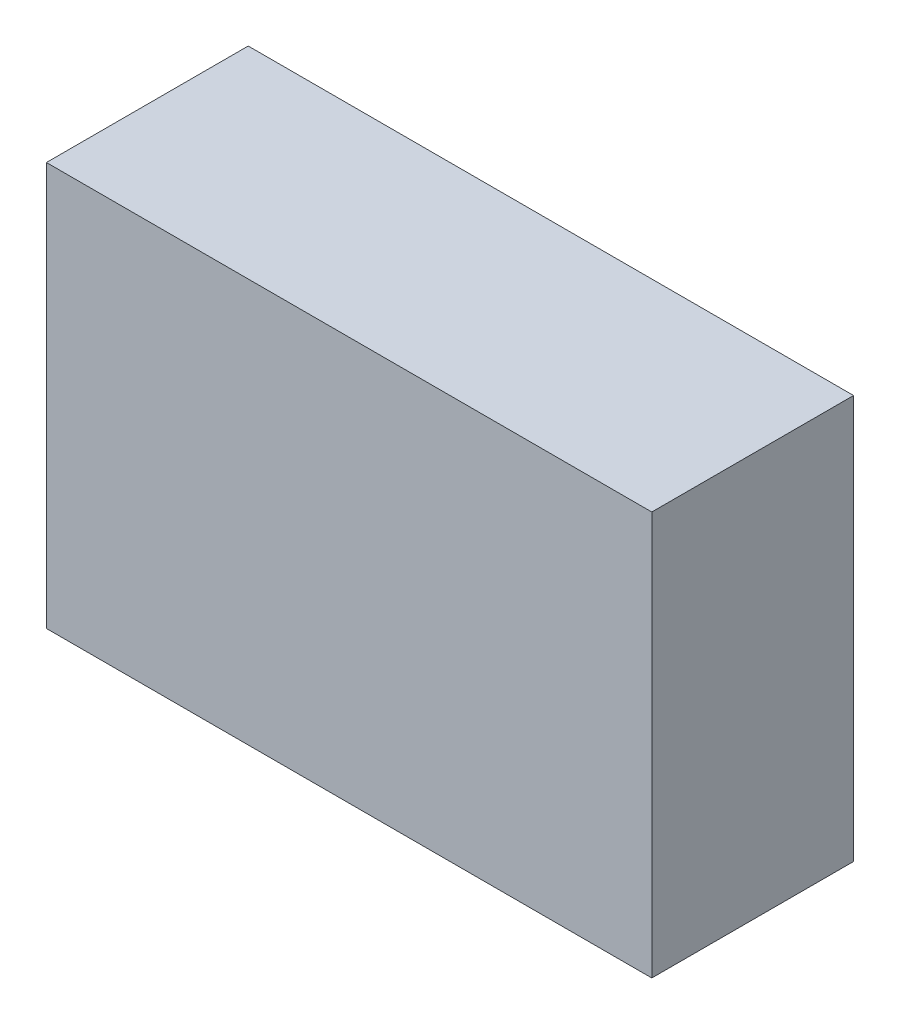
ISO-10303-21;
HEADER;
FILE_DESCRIPTION(('STEP AP214'),'2;1');
FILE_NAME('part.step','',(''),(''),'','','');
FILE_SCHEMA(('AUTOMOTIVE_DESIGN { 1 0 10303 214 1 1 1 1 }'));
ENDSEC;
DATA;
#1=APPLICATION_CONTEXT('core data for automotive mechanical design processes');
#2=APPLICATION_PROTOCOL_DEFINITION('international standard','automotive_design',2000,#1);
#3=PRODUCT_CONTEXT('',#1,'mechanical');
#4=PRODUCT('Part','Part','',(#3));
#5=PRODUCT_RELATED_PRODUCT_CATEGORY('part','',(#4));
#6=PRODUCT_DEFINITION_FORMATION('','',#4);
#7=PRODUCT_DEFINITION_CONTEXT('part definition',#1,'design');
#8=PRODUCT_DEFINITION('design','',#6,#7);
#9=PRODUCT_DEFINITION_SHAPE('','',#8);
#10=(LENGTH_UNIT() NAMED_UNIT(*) SI_UNIT(.MILLI.,.METRE.));
#11=(NAMED_UNIT(*) PLANE_ANGLE_UNIT() SI_UNIT($,.RADIAN.));
#12=(NAMED_UNIT(*) SI_UNIT($,.STERADIAN.) SOLID_ANGLE_UNIT());
#13=UNCERTAINTY_MEASURE_WITH_UNIT(LENGTH_MEASURE(1.E-05),#10,'distance_accuracy_value','');
#14=(GEOMETRIC_REPRESENTATION_CONTEXT(3) GLOBAL_UNCERTAINTY_ASSIGNED_CONTEXT((#13)) GLOBAL_UNIT_ASSIGNED_CONTEXT((#10,
#11,#12)) REPRESENTATION_CONTEXT('',''));
#15=CARTESIAN_POINT('',(0.,0.,0.));
#16=DIRECTION('',(0.,0.,1.));
#17=DIRECTION('',(1.,0.,0.));
#18=AXIS2_PLACEMENT_3D('',#15,#16,#17);
#19=CARTESIAN_POINT('',(0.,2.,0.));
#20=DIRECTION('',(1.,0.,0.));
#21=DIRECTION('',(0.,0.,-1.));
#22=AXIS2_PLACEMENT_3D('',#19,#20,#21);
#23=PLANE('',#22);
#24=DIRECTION('',(0.,0.,1.));
#25=VECTOR('',#24,1.);
#26=CARTESIAN_POINT('',(0.,0.,0.));
#27=LINE('',#26,#25);
#28=CARTESIAN_POINT('',(0.,0.,0.));
#29=VERTEX_POINT('',#28);
#30=CARTESIAN_POINT('',(0.,0.,1.));
#31=VERTEX_POINT('',#30);
#32=EDGE_CURVE('E107',#29,#31,#27,.T.);
#33=ORIENTED_EDGE('',*,*,#32,.T.);
#34=DIRECTION('',(0.,-1.,0.));
#35=VECTOR('',#34,1.);
#36=CARTESIAN_POINT('',(0.,2.,1.));
#37=LINE('',#36,#35);
#38=CARTESIAN_POINT('',(0.,2.,1.));
#39=VERTEX_POINT('',#38);
#40=EDGE_CURVE('E11',#39,#31,#37,.T.);
#41=ORIENTED_EDGE('',*,*,#40,.F.);
#42=DIRECTION('',(0.,0.,1.));
#43=VECTOR('',#42,1.);
#44=CARTESIAN_POINT('',(0.,2.,0.));
#45=LINE('',#44,#43);
#46=CARTESIAN_POINT('',(0.,2.,0.));
#47=VERTEX_POINT('',#46);
#48=EDGE_CURVE('E91',#47,#39,#45,.T.);
#49=ORIENTED_EDGE('',*,*,#48,.F.);
#50=DIRECTION('',(0.,-1.,0.));
#51=VECTOR('',#50,1.);
#52=CARTESIAN_POINT('',(0.,2.,0.));
#53=LINE('',#52,#51);
#54=EDGE_CURVE('E103',#47,#29,#53,.T.);
#55=ORIENTED_EDGE('',*,*,#54,.T.);
#56=EDGE_LOOP('',(#33,#41,#49,#55));
#57=FACE_BOUND('',#56,.T.);
#58=ADVANCED_FACE('F39',(#57),#23,.F.);
#59=CARTESIAN_POINT('',(0.,2.,1.));
#60=DIRECTION('',(0.,0.,-1.));
#61=DIRECTION('',(-1.,0.,0.));
#62=AXIS2_PLACEMENT_3D('',#59,#60,#61);
#63=PLANE('',#62);
#64=DIRECTION('',(1.,0.,0.));
#65=VECTOR('',#64,1.);
#66=CARTESIAN_POINT('',(0.,0.,1.));
#67=LINE('',#66,#65);
#68=CARTESIAN_POINT('',(3.,0.,1.));
#69=VERTEX_POINT('',#68);
#70=EDGE_CURVE('E96',#31,#69,#67,.T.);
#71=ORIENTED_EDGE('',*,*,#70,.T.);
#72=DIRECTION('',(0.,-1.,0.));
#73=VECTOR('',#72,1.);
#74=CARTESIAN_POINT('',(3.,2.,1.));
#75=LINE('',#74,#73);
#76=CARTESIAN_POINT('',(3.,2.,1.));
#77=VERTEX_POINT('',#76);
#78=EDGE_CURVE('E48',#77,#69,#75,.T.);
#79=ORIENTED_EDGE('',*,*,#78,.F.);
#80=DIRECTION('',(1.,0.,0.));
#81=VECTOR('',#80,1.);
#82=CARTESIAN_POINT('',(0.,2.,1.));
#83=LINE('',#82,#81);
#84=EDGE_CURVE('E86',#39,#77,#83,.T.);
#85=ORIENTED_EDGE('',*,*,#84,.F.);
#86=ORIENTED_EDGE('',*,*,#40,.T.);
#87=EDGE_LOOP('',(#71,#79,#85,#86));
#88=FACE_BOUND('',#87,.T.);
#89=ADVANCED_FACE('F95',(#88),#63,.F.);
#90=CARTESIAN_POINT('',(3.,2.,0.));
#91=DIRECTION('',(-1.,0.,0.));
#92=DIRECTION('',(0.,0.,1.));
#93=AXIS2_PLACEMENT_3D('',#90,#91,#92);
#94=PLANE('',#93);
#95=DIRECTION('',(0.,0.,-1.));
#96=VECTOR('',#95,1.);
#97=CARTESIAN_POINT('',(3.,0.,0.));
#98=LINE('',#97,#96);
#99=CARTESIAN_POINT('',(3.,0.,0.));
#100=VERTEX_POINT('',#99);
#101=EDGE_CURVE('E73',#69,#100,#98,.T.);
#102=ORIENTED_EDGE('',*,*,#101,.T.);
#103=DIRECTION('',(0.,-1.,0.));
#104=VECTOR('',#103,1.);
#105=CARTESIAN_POINT('',(3.,2.,0.));
#106=LINE('',#105,#104);
#107=CARTESIAN_POINT('',(3.,2.,0.));
#108=VERTEX_POINT('',#107);
#109=EDGE_CURVE('E98',#108,#100,#106,.T.);
#110=ORIENTED_EDGE('',*,*,#109,.F.);
#111=DIRECTION('',(0.,0.,-1.));
#112=VECTOR('',#111,1.);
#113=CARTESIAN_POINT('',(3.,2.,0.));
#114=LINE('',#113,#112);
#115=EDGE_CURVE('E89',#77,#108,#114,.T.);
#116=ORIENTED_EDGE('',*,*,#115,.F.);
#117=ORIENTED_EDGE('',*,*,#78,.T.);
#118=EDGE_LOOP('',(#102,#110,#116,#117));
#119=FACE_BOUND('',#118,.T.);
#120=ADVANCED_FACE('F99',(#119),#94,.F.);
#121=CARTESIAN_POINT('',(0.,2.,0.));
#122=DIRECTION('',(0.,0.,1.));
#123=DIRECTION('',(1.,0.,0.));
#124=AXIS2_PLACEMENT_3D('',#121,#122,#123);
#125=PLANE('',#124);
#126=DIRECTION('',(-1.,0.,0.));
#127=VECTOR('',#126,1.);
#128=CARTESIAN_POINT('',(0.,0.,0.));
#129=LINE('',#128,#127);
#130=EDGE_CURVE('E79',#100,#29,#129,.T.);
#131=ORIENTED_EDGE('',*,*,#130,.T.);
#132=ORIENTED_EDGE('',*,*,#54,.F.);
#133=DIRECTION('',(-1.,0.,0.));
#134=VECTOR('',#133,1.);
#135=CARTESIAN_POINT('',(0.,2.,0.));
#136=LINE('',#135,#134);
#137=EDGE_CURVE('E56',#108,#47,#136,.T.);
#138=ORIENTED_EDGE('',*,*,#137,.F.);
#139=ORIENTED_EDGE('',*,*,#109,.T.);
#140=EDGE_LOOP('',(#131,#132,#138,#139));
#141=FACE_BOUND('',#140,.T.);
#142=ADVANCED_FACE('F120',(#141),#125,.F.);
#143=CARTESIAN_POINT('',(0.,2.,0.));
#144=DIRECTION('',(0.,1.,0.));
#145=DIRECTION('',(0.,0.,1.));
#146=AXIS2_PLACEMENT_3D('',#143,#144,#145);
#147=PLANE('',#146);
#148=ORIENTED_EDGE('',*,*,#48,.T.);
#149=ORIENTED_EDGE('',*,*,#84,.T.);
#150=ORIENTED_EDGE('',*,*,#115,.T.);
#151=ORIENTED_EDGE('',*,*,#137,.T.);
#152=EDGE_LOOP('',(#148,#149,#150,#151));
#153=FACE_BOUND('',#152,.T.);
#154=ADVANCED_FACE('F87',(#153),#147,.T.);
#155=CARTESIAN_POINT('',(0.,0.,0.));
#156=DIRECTION('',(0.,1.,0.));
#157=DIRECTION('',(0.,0.,1.));
#158=AXIS2_PLACEMENT_3D('',#155,#156,#157);
#159=PLANE('',#158);
#160=ORIENTED_EDGE('',*,*,#32,.F.);
#161=ORIENTED_EDGE('',*,*,#130,.F.);
#162=ORIENTED_EDGE('',*,*,#101,.F.);
#163=ORIENTED_EDGE('',*,*,#70,.F.);
#164=EDGE_LOOP('',(#160,#161,#162,#163));
#165=FACE_BOUND('',#164,.T.);
#166=ADVANCED_FACE('F123',(#165),#159,.F.);
#167=CLOSED_SHELL('',(#58,#89,#120,#142,#154,#166));
#168=MANIFOLD_SOLID_BREP('B2',#167);
#169=ADVANCED_BREP_SHAPE_REPRESENTATION('',(#18,#168),#14);
#170=SHAPE_DEFINITION_REPRESENTATION(#9,#169);
ENDSEC;
END-ISO-10303-21;
